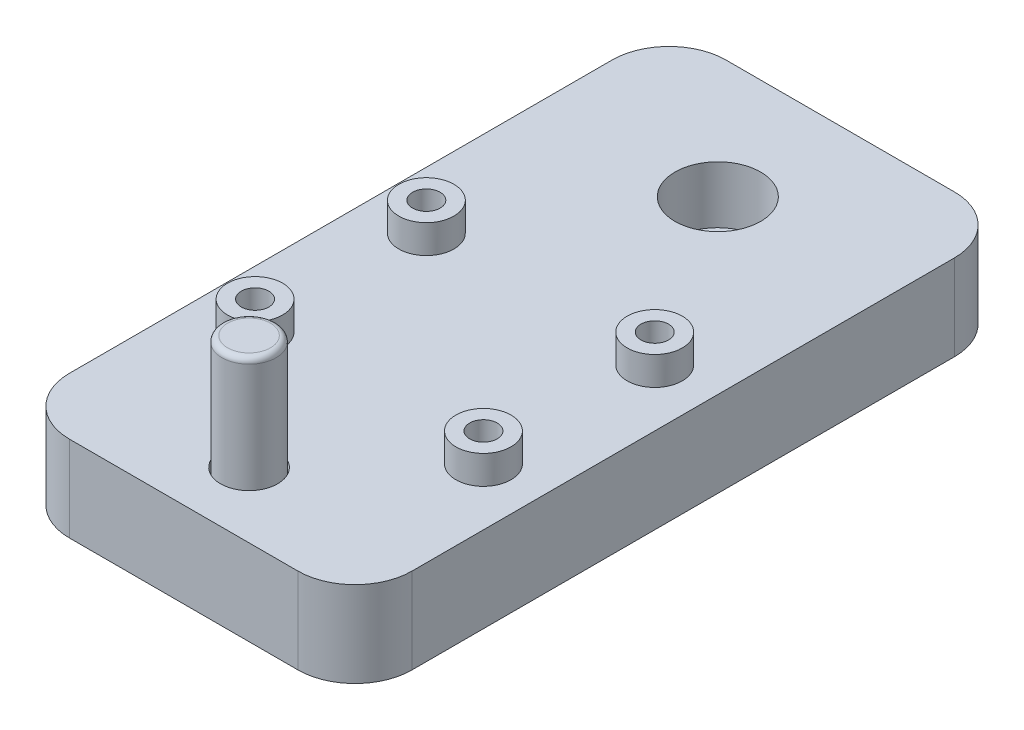
ISO-10303-21;
HEADER;
FILE_DESCRIPTION(('STEP AP214'),'2;1');
FILE_NAME('part.step','',(''),(''),'','','');
FILE_SCHEMA(('AUTOMOTIVE_DESIGN { 1 0 10303 214 1 1 1 1 }'));
ENDSEC;
DATA;
#1=APPLICATION_CONTEXT('core data for automotive mechanical design processes');
#2=APPLICATION_PROTOCOL_DEFINITION('international standard','automotive_design',2000,#1);
#3=PRODUCT_CONTEXT('',#1,'mechanical');
#4=PRODUCT('Part','Part','',(#3));
#5=PRODUCT_RELATED_PRODUCT_CATEGORY('part','',(#4));
#6=PRODUCT_DEFINITION_FORMATION('','',#4);
#7=PRODUCT_DEFINITION_CONTEXT('part definition',#1,'design');
#8=PRODUCT_DEFINITION('design','',#6,#7);
#9=PRODUCT_DEFINITION_SHAPE('','',#8);
#10=(LENGTH_UNIT() NAMED_UNIT(*) SI_UNIT(.MILLI.,.METRE.));
#11=(NAMED_UNIT(*) PLANE_ANGLE_UNIT() SI_UNIT($,.RADIAN.));
#12=(NAMED_UNIT(*) SI_UNIT($,.STERADIAN.) SOLID_ANGLE_UNIT());
#13=UNCERTAINTY_MEASURE_WITH_UNIT(LENGTH_MEASURE(1.E-05),#10,'distance_accuracy_value','');
#14=(GEOMETRIC_REPRESENTATION_CONTEXT(3) GLOBAL_UNCERTAINTY_ASSIGNED_CONTEXT((#13)) GLOBAL_UNIT_ASSIGNED_CONTEXT((#10,
#11,#12)) REPRESENTATION_CONTEXT('',''));
#15=CARTESIAN_POINT('',(0.,0.,0.));
#16=DIRECTION('',(0.,0.,1.));
#17=DIRECTION('',(1.,0.,0.));
#18=AXIS2_PLACEMENT_3D('',#15,#16,#17);
#19=CARTESIAN_POINT('',(0.,15.,0.));
#20=DIRECTION('',(1.,0.,0.));
#21=DIRECTION('',(0.,0.,-1.));
#22=AXIS2_PLACEMENT_3D('',#19,#20,#21);
#23=PLANE('',#22);
#24=DIRECTION('',(0.,0.,1.));
#25=VECTOR('',#24,1.);
#26=CARTESIAN_POINT('',(0.,15.,0.));
#27=LINE('',#26,#25);
#28=CARTESIAN_POINT('',(0.,15.,-105.));
#29=VERTEX_POINT('',#28);
#30=CARTESIAN_POINT('',(0.,15.,-10.));
#31=VERTEX_POINT('',#30);
#32=EDGE_CURVE('E122',#29,#31,#27,.T.);
#33=ORIENTED_EDGE('',*,*,#32,.F.);
#34=DIRECTION('',(0.,-1.,0.));
#35=VECTOR('',#34,1.);
#36=CARTESIAN_POINT('',(0.,15.,-105.));
#37=LINE('',#36,#35);
#38=CARTESIAN_POINT('',(0.,0.,-105.));
#39=VERTEX_POINT('',#38);
#40=EDGE_CURVE('E107',#29,#39,#37,.T.);
#41=ORIENTED_EDGE('',*,*,#40,.T.);
#42=DIRECTION('',(0.,0.,1.));
#43=VECTOR('',#42,1.);
#44=CARTESIAN_POINT('',(0.,0.,0.));
#45=LINE('',#44,#43);
#46=CARTESIAN_POINT('',(0.,0.,-10.));
#47=VERTEX_POINT('',#46);
#48=EDGE_CURVE('E119',#39,#47,#45,.T.);
#49=ORIENTED_EDGE('',*,*,#48,.T.);
#50=DIRECTION('',(0.,-1.,0.));
#51=VECTOR('',#50,1.);
#52=CARTESIAN_POINT('',(0.,15.,-10.));
#53=LINE('',#52,#51);
#54=EDGE_CURVE('E124',#47,#31,#53,.F.);
#55=ORIENTED_EDGE('',*,*,#54,.T.);
#56=EDGE_LOOP('',(#33,#41,#49,#55));
#57=FACE_BOUND('',#56,.T.);
#58=ADVANCED_FACE('F36',(#57),#23,.F.);
#59=CARTESIAN_POINT('',(0.,15.,0.));
#60=DIRECTION('',(0.,0.,-1.));
#61=DIRECTION('',(-1.,0.,0.));
#62=AXIS2_PLACEMENT_3D('',#59,#60,#61);
#63=PLANE('',#62);
#64=DIRECTION('',(1.,0.,0.));
#65=VECTOR('',#64,1.);
#66=CARTESIAN_POINT('',(0.,0.,0.));
#67=LINE('',#66,#65);
#68=CARTESIAN_POINT('',(10.,0.,0.));
#69=VERTEX_POINT('',#68);
#70=CARTESIAN_POINT('',(50.,0.,0.));
#71=VERTEX_POINT('',#70);
#72=EDGE_CURVE('E128',#69,#71,#67,.T.);
#73=ORIENTED_EDGE('',*,*,#72,.T.);
#74=DIRECTION('',(0.,-1.,0.));
#75=VECTOR('',#74,1.);
#76=CARTESIAN_POINT('',(50.,15.,0.));
#77=LINE('',#76,#75);
#78=CARTESIAN_POINT('',(50.,15.,0.));
#79=VERTEX_POINT('',#78);
#80=EDGE_CURVE('E172',#71,#79,#77,.F.);
#81=ORIENTED_EDGE('',*,*,#80,.T.);
#82=DIRECTION('',(1.,0.,0.));
#83=VECTOR('',#82,1.);
#84=CARTESIAN_POINT('',(0.,15.,0.));
#85=LINE('',#84,#83);
#86=CARTESIAN_POINT('',(10.,15.,0.));
#87=VERTEX_POINT('',#86);
#88=EDGE_CURVE('E208',#87,#79,#85,.T.);
#89=ORIENTED_EDGE('',*,*,#88,.F.);
#90=DIRECTION('',(0.,-1.,0.));
#91=VECTOR('',#90,1.);
#92=CARTESIAN_POINT('',(10.,15.,0.));
#93=LINE('',#92,#91);
#94=EDGE_CURVE('E169',#87,#69,#93,.T.);
#95=ORIENTED_EDGE('',*,*,#94,.T.);
#96=EDGE_LOOP('',(#73,#81,#89,#95));
#97=FACE_BOUND('',#96,.T.);
#98=ADVANCED_FACE('F283',(#97),#63,.F.);
#99=CARTESIAN_POINT('',(60.,15.,0.));
#100=DIRECTION('',(-1.,0.,0.));
#101=DIRECTION('',(0.,0.,1.));
#102=AXIS2_PLACEMENT_3D('',#99,#100,#101);
#103=PLANE('',#102);
#104=DIRECTION('',(0.,0.,-1.));
#105=VECTOR('',#104,1.);
#106=CARTESIAN_POINT('',(60.,0.,0.));
#107=LINE('',#106,#105);
#108=CARTESIAN_POINT('',(60.,0.,-10.));
#109=VERTEX_POINT('',#108);
#110=CARTESIAN_POINT('',(60.,0.,-105.));
#111=VERTEX_POINT('',#110);
#112=EDGE_CURVE('E132',#109,#111,#107,.T.);
#113=ORIENTED_EDGE('',*,*,#112,.T.);
#114=DIRECTION('',(0.,-1.,0.));
#115=VECTOR('',#114,1.);
#116=CARTESIAN_POINT('',(60.,15.,-105.));
#117=LINE('',#116,#115);
#118=CARTESIAN_POINT('',(60.,15.,-105.));
#119=VERTEX_POINT('',#118);
#120=EDGE_CURVE('E51',#111,#119,#117,.F.);
#121=ORIENTED_EDGE('',*,*,#120,.T.);
#122=DIRECTION('',(0.,0.,-1.));
#123=VECTOR('',#122,1.);
#124=CARTESIAN_POINT('',(60.,15.,0.));
#125=LINE('',#124,#123);
#126=CARTESIAN_POINT('',(60.,15.,-10.));
#127=VERTEX_POINT('',#126);
#128=EDGE_CURVE('E207',#127,#119,#125,.T.);
#129=ORIENTED_EDGE('',*,*,#128,.F.);
#130=DIRECTION('',(0.,-1.,0.));
#131=VECTOR('',#130,1.);
#132=CARTESIAN_POINT('',(60.,15.,-10.));
#133=LINE('',#132,#131);
#134=EDGE_CURVE('E165',#127,#109,#133,.T.);
#135=ORIENTED_EDGE('',*,*,#134,.T.);
#136=EDGE_LOOP('',(#113,#121,#129,#135));
#137=FACE_BOUND('',#136,.T.);
#138=ADVANCED_FACE('F288',(#137),#103,.F.);
#139=CARTESIAN_POINT('',(0.,15.,-115.));
#140=DIRECTION('',(0.,0.,1.));
#141=DIRECTION('',(1.,0.,0.));
#142=AXIS2_PLACEMENT_3D('',#139,#140,#141);
#143=PLANE('',#142);
#144=DIRECTION('',(-1.,0.,0.));
#145=VECTOR('',#144,1.);
#146=CARTESIAN_POINT('',(0.,0.,-115.));
#147=LINE('',#146,#145);
#148=CARTESIAN_POINT('',(50.,0.,-115.));
#149=VERTEX_POINT('',#148);
#150=CARTESIAN_POINT('',(10.,0.,-115.));
#151=VERTEX_POINT('',#150);
#152=EDGE_CURVE('E142',#149,#151,#147,.T.);
#153=ORIENTED_EDGE('',*,*,#152,.T.);
#154=DIRECTION('',(0.,-1.,0.));
#155=VECTOR('',#154,1.);
#156=CARTESIAN_POINT('',(10.,15.,-115.));
#157=LINE('',#156,#155);
#158=CARTESIAN_POINT('',(10.,15.,-115.));
#159=VERTEX_POINT('',#158);
#160=EDGE_CURVE('E108',#151,#159,#157,.F.);
#161=ORIENTED_EDGE('',*,*,#160,.T.);
#162=DIRECTION('',(-1.,0.,0.));
#163=VECTOR('',#162,1.);
#164=CARTESIAN_POINT('',(0.,15.,-115.));
#165=LINE('',#164,#163);
#166=CARTESIAN_POINT('',(50.,15.,-115.));
#167=VERTEX_POINT('',#166);
#168=EDGE_CURVE('E138',#167,#159,#165,.T.);
#169=ORIENTED_EDGE('',*,*,#168,.F.);
#170=DIRECTION('',(0.,-1.,0.));
#171=VECTOR('',#170,1.);
#172=CARTESIAN_POINT('',(50.,15.,-115.));
#173=LINE('',#172,#171);
#174=EDGE_CURVE('E113',#167,#149,#173,.T.);
#175=ORIENTED_EDGE('',*,*,#174,.T.);
#176=EDGE_LOOP('',(#153,#161,#169,#175));
#177=FACE_BOUND('',#176,.T.);
#178=ADVANCED_FACE('F187',(#177),#143,.F.);
#179=CARTESIAN_POINT('',(0.,15.,0.));
#180=DIRECTION('',(0.,-1.,0.));
#181=DIRECTION('',(0.,0.,-1.));
#182=AXIS2_PLACEMENT_3D('',#179,#180,#181);
#183=PLANE('',#182);
#184=CARTESIAN_POINT('',(50.,15.,-62.5));
#185=DIRECTION('',(0.,-1.,0.));
#186=DIRECTION('',(0.,0.,-1.));
#187=AXIS2_PLACEMENT_3D('',#184,#185,#186);
#188=CIRCLE('',#187,4.826);
#189=CARTESIAN_POINT('',(50.,15.,-67.326));
#190=VERTEX_POINT('',#189);
#191=EDGE_CURVE('E11',#190,#190,#188,.F.);
#192=ORIENTED_EDGE('',*,*,#191,.F.);
#193=EDGE_LOOP('',(#192));
#194=FACE_BOUND('',#193,.T.);
#195=CARTESIAN_POINT('',(10.,15.,-62.5));
#196=DIRECTION('',(0.,-1.,0.));
#197=DIRECTION('',(0.,0.,-1.));
#198=AXIS2_PLACEMENT_3D('',#195,#196,#197);
#199=CIRCLE('',#198,4.826);
#200=CARTESIAN_POINT('',(10.,15.,-67.326));
#201=VERTEX_POINT('',#200);
#202=EDGE_CURVE('E44',#201,#201,#199,.F.);
#203=ORIENTED_EDGE('',*,*,#202,.F.);
#204=EDGE_LOOP('',(#203));
#205=FACE_BOUND('',#204,.T.);
#206=CARTESIAN_POINT('',(10.,15.,-32.5));
#207=DIRECTION('',(0.,-1.,0.));
#208=DIRECTION('',(0.,0.,-1.));
#209=AXIS2_PLACEMENT_3D('',#206,#207,#208);
#210=CIRCLE('',#209,4.826);
#211=CARTESIAN_POINT('',(10.,15.,-37.326));
#212=VERTEX_POINT('',#211);
#213=EDGE_CURVE('E177',#212,#212,#210,.F.);
#214=ORIENTED_EDGE('',*,*,#213,.F.);
#215=EDGE_LOOP('',(#214));
#216=FACE_BOUND('',#215,.T.);
#217=CARTESIAN_POINT('',(50.,15.,-32.5));
#218=DIRECTION('',(0.,-1.,0.));
#219=DIRECTION('',(0.,0.,-1.));
#220=AXIS2_PLACEMENT_3D('',#217,#218,#219);
#221=CIRCLE('',#220,4.826);
#222=CARTESIAN_POINT('',(50.,15.,-37.326));
#223=VERTEX_POINT('',#222);
#224=EDGE_CURVE('E174',#223,#223,#221,.F.);
#225=ORIENTED_EDGE('',*,*,#224,.F.);
#226=EDGE_LOOP('',(#225));
#227=FACE_BOUND('',#226,.T.);
#228=CARTESIAN_POINT('',(30.,15.,-93.55));
#229=DIRECTION('',(0.,1.,0.));
#230=DIRECTION('',(0.,0.,1.));
#231=AXIS2_PLACEMENT_3D('',#228,#229,#230);
#232=CIRCLE('',#231,7.5);
#233=CARTESIAN_POINT('',(30.,15.,-86.05));
#234=VERTEX_POINT('',#233);
#235=EDGE_CURVE('E135',#234,#234,#232,.T.);
#236=ORIENTED_EDGE('',*,*,#235,.F.);
#237=EDGE_LOOP('',(#236));
#238=FACE_BOUND('',#237,.T.);
#239=CARTESIAN_POINT('',(30.,15.,-11.45));
#240=DIRECTION('',(0.,1.,0.));
#241=DIRECTION('',(0.,0.,1.));
#242=AXIS2_PLACEMENT_3D('',#239,#240,#241);
#243=CIRCLE('',#242,5.);
#244=CARTESIAN_POINT('',(30.,15.,-6.45));
#245=VERTEX_POINT('',#244);
#246=EDGE_CURVE('E201',#245,#245,#243,.T.);
#247=ORIENTED_EDGE('',*,*,#246,.F.);
#248=EDGE_LOOP('',(#247));
#249=FACE_BOUND('',#248,.T.);
#250=ORIENTED_EDGE('',*,*,#168,.T.);
#251=CARTESIAN_POINT('',(10.,15.,-105.));
#252=DIRECTION('',(0.,-1.,0.));
#253=DIRECTION('',(0.,0.,-1.));
#254=AXIS2_PLACEMENT_3D('',#251,#252,#253);
#255=CIRCLE('',#254,10.);
#256=EDGE_CURVE('E163',#159,#29,#255,.F.);
#257=ORIENTED_EDGE('',*,*,#256,.T.);
#258=ORIENTED_EDGE('',*,*,#32,.T.);
#259=CARTESIAN_POINT('',(10.,15.,-10.));
#260=DIRECTION('',(0.,-1.,0.));
#261=DIRECTION('',(0.,0.,-1.));
#262=AXIS2_PLACEMENT_3D('',#259,#260,#261);
#263=CIRCLE('',#262,10.);
#264=EDGE_CURVE('E158',#31,#87,#263,.F.);
#265=ORIENTED_EDGE('',*,*,#264,.T.);
#266=ORIENTED_EDGE('',*,*,#88,.T.);
#267=CARTESIAN_POINT('',(50.,15.,-10.));
#268=DIRECTION('',(0.,-1.,0.));
#269=DIRECTION('',(0.,0.,-1.));
#270=AXIS2_PLACEMENT_3D('',#267,#268,#269);
#271=CIRCLE('',#270,10.);
#272=EDGE_CURVE('E58',#79,#127,#271,.F.);
#273=ORIENTED_EDGE('',*,*,#272,.T.);
#274=ORIENTED_EDGE('',*,*,#128,.T.);
#275=CARTESIAN_POINT('',(50.,15.,-105.));
#276=DIRECTION('',(0.,-1.,0.));
#277=DIRECTION('',(0.,0.,-1.));
#278=AXIS2_PLACEMENT_3D('',#275,#276,#277);
#279=CIRCLE('',#278,10.);
#280=EDGE_CURVE('E161',#119,#167,#279,.F.);
#281=ORIENTED_EDGE('',*,*,#280,.T.);
#282=EDGE_LOOP('',(#250,#257,#258,#265,#266,#273,#274,#281));
#283=FACE_BOUND('',#282,.T.);
#284=ADVANCED_FACE('F184',(#194,#205,#216,#227,#238,#249,#283),#183,.F.);
#285=CARTESIAN_POINT('',(0.,0.,0.));
#286=DIRECTION('',(0.,-1.,0.));
#287=DIRECTION('',(0.,0.,-1.));
#288=AXIS2_PLACEMENT_3D('',#285,#286,#287);
#289=PLANE('',#288);
#290=CARTESIAN_POINT('',(30.,0.,-57.5));
#291=DIRECTION('',(0.,-1.,0.));
#292=DIRECTION('',(0.,0.,-1.));
#293=AXIS2_PLACEMENT_3D('',#290,#291,#292);
#294=CIRCLE('',#293,5.);
#295=CARTESIAN_POINT('',(30.,0.,-62.5));
#296=VERTEX_POINT('',#295);
#297=EDGE_CURVE('E218',#296,#296,#294,.T.);
#298=ORIENTED_EDGE('',*,*,#297,.F.);
#299=EDGE_LOOP('',(#298));
#300=FACE_BOUND('',#299,.T.);
#301=ORIENTED_EDGE('',*,*,#48,.F.);
#302=CARTESIAN_POINT('',(10.,0.,-105.));
#303=DIRECTION('',(0.,-1.,0.));
#304=DIRECTION('',(0.,0.,-1.));
#305=AXIS2_PLACEMENT_3D('',#302,#303,#304);
#306=CIRCLE('',#305,10.);
#307=EDGE_CURVE('E103',#39,#151,#306,.T.);
#308=ORIENTED_EDGE('',*,*,#307,.T.);
#309=ORIENTED_EDGE('',*,*,#152,.F.);
#310=CARTESIAN_POINT('',(50.,0.,-105.));
#311=DIRECTION('',(0.,-1.,0.));
#312=DIRECTION('',(0.,0.,-1.));
#313=AXIS2_PLACEMENT_3D('',#310,#311,#312);
#314=CIRCLE('',#313,10.);
#315=EDGE_CURVE('E114',#149,#111,#314,.T.);
#316=ORIENTED_EDGE('',*,*,#315,.T.);
#317=ORIENTED_EDGE('',*,*,#112,.F.);
#318=CARTESIAN_POINT('',(50.,0.,-10.));
#319=DIRECTION('',(0.,-1.,0.));
#320=DIRECTION('',(0.,0.,-1.));
#321=AXIS2_PLACEMENT_3D('',#318,#319,#320);
#322=CIRCLE('',#321,10.);
#323=EDGE_CURVE('E152',#109,#71,#322,.T.);
#324=ORIENTED_EDGE('',*,*,#323,.T.);
#325=ORIENTED_EDGE('',*,*,#72,.F.);
#326=CARTESIAN_POINT('',(10.,0.,-10.));
#327=DIRECTION('',(0.,-1.,0.));
#328=DIRECTION('',(0.,0.,-1.));
#329=AXIS2_PLACEMENT_3D('',#326,#327,#328);
#330=CIRCLE('',#329,10.);
#331=EDGE_CURVE('E123',#69,#47,#330,.T.);
#332=ORIENTED_EDGE('',*,*,#331,.T.);
#333=EDGE_LOOP('',(#301,#308,#309,#316,#317,#324,#325,#332));
#334=FACE_BOUND('',#333,.T.);
#335=ADVANCED_FACE('F126',(#300,#334),#289,.T.);
#336=CARTESIAN_POINT('',(30.,5.,-11.45));
#337=DIRECTION('',(0.,1.,0.));
#338=DIRECTION('',(0.,0.,1.));
#339=AXIS2_PLACEMENT_3D('',#336,#337,#338);
#340=CYLINDRICAL_SURFACE('',#339,5.);
#341=CARTESIAN_POINT('',(30.,5.,-11.45));
#342=DIRECTION('',(0.,1.,0.));
#343=DIRECTION('',(0.,0.,1.));
#344=AXIS2_PLACEMENT_3D('',#341,#342,#343);
#345=CIRCLE('',#344,5.);
#346=CARTESIAN_POINT('',(30.,5.,-6.45));
#347=VERTEX_POINT('',#346);
#348=EDGE_CURVE('E213',#347,#347,#345,.T.);
#349=ORIENTED_EDGE('',*,*,#348,.F.);
#350=EDGE_LOOP('',(#349));
#351=FACE_BOUND('',#350,.T.);
#352=ORIENTED_EDGE('',*,*,#246,.T.);
#353=EDGE_LOOP('',(#352));
#354=FACE_BOUND('',#353,.T.);
#355=ADVANCED_FACE('F321',(#351,#354),#340,.F.);
#356=CARTESIAN_POINT('',(30.,5.,-11.45));
#357=DIRECTION('',(0.,1.,0.));
#358=DIRECTION('',(0.,0.,1.));
#359=AXIS2_PLACEMENT_3D('',#356,#357,#358);
#360=PLANE('',#359);
#361=CARTESIAN_POINT('',(30.,5.,-11.45));
#362=DIRECTION('',(0.,1.,0.));
#363=DIRECTION('',(0.,0.,1.));
#364=AXIS2_PLACEMENT_3D('',#361,#362,#363);
#365=CIRCLE('',#364,4.75);
#366=CARTESIAN_POINT('',(30.,5.,-6.7));
#367=VERTEX_POINT('',#366);
#368=EDGE_CURVE('E221',#367,#367,#365,.T.);
#369=ORIENTED_EDGE('',*,*,#368,.F.);
#370=EDGE_LOOP('',(#369));
#371=FACE_BOUND('',#370,.T.);
#372=ORIENTED_EDGE('',*,*,#348,.T.);
#373=EDGE_LOOP('',(#372));
#374=FACE_BOUND('',#373,.T.);
#375=ADVANCED_FACE('F326',(#371,#374),#360,.T.);
#376=CARTESIAN_POINT('',(30.,5.,-93.55));
#377=DIRECTION('',(0.,1.,0.));
#378=DIRECTION('',(0.,0.,1.));
#379=AXIS2_PLACEMENT_3D('',#376,#377,#378);
#380=CYLINDRICAL_SURFACE('',#379,7.5);
#381=CARTESIAN_POINT('',(30.,5.,-93.55));
#382=DIRECTION('',(0.,1.,0.));
#383=DIRECTION('',(0.,0.,1.));
#384=AXIS2_PLACEMENT_3D('',#381,#382,#383);
#385=CIRCLE('',#384,7.5);
#386=CARTESIAN_POINT('',(30.,5.,-86.05));
#387=VERTEX_POINT('',#386);
#388=EDGE_CURVE('E129',#387,#387,#385,.T.);
#389=ORIENTED_EDGE('',*,*,#388,.F.);
#390=EDGE_LOOP('',(#389));
#391=FACE_BOUND('',#390,.T.);
#392=ORIENTED_EDGE('',*,*,#235,.T.);
#393=EDGE_LOOP('',(#392));
#394=FACE_BOUND('',#393,.T.);
#395=ADVANCED_FACE('F330',(#391,#394),#380,.F.);
#396=CARTESIAN_POINT('',(30.,5.,-93.55));
#397=DIRECTION('',(0.,1.,0.));
#398=DIRECTION('',(0.,0.,1.));
#399=AXIS2_PLACEMENT_3D('',#396,#397,#398);
#400=PLANE('',#399);
#401=ORIENTED_EDGE('',*,*,#388,.T.);
#402=EDGE_LOOP('',(#401));
#403=FACE_BOUND('',#402,.T.);
#404=ADVANCED_FACE('F334',(#403),#400,.T.);
#405=CARTESIAN_POINT('',(30.,14.5,-57.5));
#406=DIRECTION('',(0.,-1.,0.));
#407=DIRECTION('',(0.,0.,-1.));
#408=AXIS2_PLACEMENT_3D('',#405,#406,#407);
#409=CYLINDRICAL_SURFACE('',#408,5.);
#410=CARTESIAN_POINT('',(30.,14.5,-57.5));
#411=DIRECTION('',(0.,-1.,0.));
#412=DIRECTION('',(0.,0.,-1.));
#413=AXIS2_PLACEMENT_3D('',#410,#411,#412);
#414=CIRCLE('',#413,5.);
#415=CARTESIAN_POINT('',(30.,14.5,-62.5));
#416=VERTEX_POINT('',#415);
#417=EDGE_CURVE('E214',#416,#416,#414,.T.);
#418=ORIENTED_EDGE('',*,*,#417,.F.);
#419=EDGE_LOOP('',(#418));
#420=FACE_BOUND('',#419,.T.);
#421=ORIENTED_EDGE('',*,*,#297,.T.);
#422=EDGE_LOOP('',(#421));
#423=FACE_BOUND('',#422,.T.);
#424=ADVANCED_FACE('F338',(#420,#423),#409,.F.);
#425=CARTESIAN_POINT('',(30.,14.5,-57.5));
#426=DIRECTION('',(0.,-1.,0.));
#427=DIRECTION('',(0.,0.,-1.));
#428=AXIS2_PLACEMENT_3D('',#425,#426,#427);
#429=PLANE('',#428);
#430=ORIENTED_EDGE('',*,*,#417,.T.);
#431=EDGE_LOOP('',(#430));
#432=FACE_BOUND('',#431,.T.);
#433=ADVANCED_FACE('F342',(#432),#429,.T.);
#434=CARTESIAN_POINT('',(30.,35.,-11.45));
#435=DIRECTION('',(0.,-1.,0.));
#436=DIRECTION('',(0.,0.,-1.));
#437=AXIS2_PLACEMENT_3D('',#434,#435,#436);
#438=CYLINDRICAL_SURFACE('',#437,4.75);
#439=CARTESIAN_POINT('',(30.,34.,-11.45));
#440=DIRECTION('',(0.,1.,0.));
#441=DIRECTION('',(0.,0.,1.));
#442=AXIS2_PLACEMENT_3D('',#439,#440,#441);
#443=CIRCLE('',#442,4.75);
#444=CARTESIAN_POINT('',(30.,34.,-6.7));
#445=VERTEX_POINT('',#444);
#446=EDGE_CURVE('E147',#445,#445,#443,.F.);
#447=ORIENTED_EDGE('',*,*,#446,.T.);
#448=EDGE_LOOP('',(#447));
#449=FACE_BOUND('',#448,.T.);
#450=ORIENTED_EDGE('',*,*,#368,.T.);
#451=EDGE_LOOP('',(#450));
#452=FACE_BOUND('',#451,.T.);
#453=ADVANCED_FACE('F346',(#449,#452),#438,.T.);
#454=CARTESIAN_POINT('',(30.,35.,-11.45));
#455=DIRECTION('',(0.,1.,0.));
#456=DIRECTION('',(0.,0.,1.));
#457=AXIS2_PLACEMENT_3D('',#454,#455,#456);
#458=PLANE('',#457);
#459=CARTESIAN_POINT('',(30.,35.,-11.45));
#460=DIRECTION('',(0.,1.,0.));
#461=DIRECTION('',(0.,0.,1.));
#462=AXIS2_PLACEMENT_3D('',#459,#460,#461);
#463=CIRCLE('',#462,3.75);
#464=CARTESIAN_POINT('',(30.,35.,-7.7));
#465=VERTEX_POINT('',#464);
#466=EDGE_CURVE('E144',#465,#465,#463,.T.);
#467=ORIENTED_EDGE('',*,*,#466,.T.);
#468=EDGE_LOOP('',(#467));
#469=FACE_BOUND('',#468,.T.);
#470=ADVANCED_FACE('F296',(#469),#458,.T.);
#471=CARTESIAN_POINT('',(30.,34.,-11.45));
#472=DIRECTION('',(0.,1.,0.));
#473=DIRECTION('',(0.,0.,1.));
#474=AXIS2_PLACEMENT_3D('',#471,#472,#473);
#475=TOROIDAL_SURFACE('',#474,3.75,1.);
#476=ORIENTED_EDGE('',*,*,#446,.F.);
#477=EDGE_LOOP('',(#476));
#478=FACE_BOUND('',#477,.T.);
#479=ORIENTED_EDGE('',*,*,#466,.F.);
#480=EDGE_LOOP('',(#479));
#481=FACE_BOUND('',#480,.T.);
#482=ADVANCED_FACE('F293',(#478,#481),#475,.T.);
#483=CARTESIAN_POINT('',(10.,15.,-105.));
#484=DIRECTION('',(0.,-1.,0.));
#485=DIRECTION('',(0.,0.,-1.));
#486=AXIS2_PLACEMENT_3D('',#483,#484,#485);
#487=CYLINDRICAL_SURFACE('',#486,10.);
#488=ORIENTED_EDGE('',*,*,#256,.F.);
#489=ORIENTED_EDGE('',*,*,#160,.F.);
#490=ORIENTED_EDGE('',*,*,#307,.F.);
#491=ORIENTED_EDGE('',*,*,#40,.F.);
#492=EDGE_LOOP('',(#488,#489,#490,#491));
#493=FACE_BOUND('',#492,.T.);
#494=ADVANCED_FACE('F106',(#493),#487,.T.);
#495=CARTESIAN_POINT('',(50.,15.,-105.));
#496=DIRECTION('',(0.,-1.,0.));
#497=DIRECTION('',(0.,0.,-1.));
#498=AXIS2_PLACEMENT_3D('',#495,#496,#497);
#499=CYLINDRICAL_SURFACE('',#498,10.);
#500=ORIENTED_EDGE('',*,*,#280,.F.);
#501=ORIENTED_EDGE('',*,*,#120,.F.);
#502=ORIENTED_EDGE('',*,*,#315,.F.);
#503=ORIENTED_EDGE('',*,*,#174,.F.);
#504=EDGE_LOOP('',(#500,#501,#502,#503));
#505=FACE_BOUND('',#504,.T.);
#506=ADVANCED_FACE('F300',(#505),#499,.T.);
#507=CARTESIAN_POINT('',(50.,15.,-10.));
#508=DIRECTION('',(0.,-1.,0.));
#509=DIRECTION('',(0.,0.,-1.));
#510=AXIS2_PLACEMENT_3D('',#507,#508,#509);
#511=CYLINDRICAL_SURFACE('',#510,10.);
#512=ORIENTED_EDGE('',*,*,#272,.F.);
#513=ORIENTED_EDGE('',*,*,#80,.F.);
#514=ORIENTED_EDGE('',*,*,#323,.F.);
#515=ORIENTED_EDGE('',*,*,#134,.F.);
#516=EDGE_LOOP('',(#512,#513,#514,#515));
#517=FACE_BOUND('',#516,.T.);
#518=ADVANCED_FACE('F302',(#517),#511,.T.);
#519=CARTESIAN_POINT('',(10.,15.,-10.));
#520=DIRECTION('',(0.,-1.,0.));
#521=DIRECTION('',(0.,0.,-1.));
#522=AXIS2_PLACEMENT_3D('',#519,#520,#521);
#523=CYLINDRICAL_SURFACE('',#522,10.);
#524=ORIENTED_EDGE('',*,*,#264,.F.);
#525=ORIENTED_EDGE('',*,*,#54,.F.);
#526=ORIENTED_EDGE('',*,*,#331,.F.);
#527=ORIENTED_EDGE('',*,*,#94,.F.);
#528=EDGE_LOOP('',(#524,#525,#526,#527));
#529=FACE_BOUND('',#528,.T.);
#530=ADVANCED_FACE('F38',(#529),#523,.T.);
#531=CARTESIAN_POINT('',(50.,20.,-32.5));
#532=DIRECTION('',(0.,1.,0.));
#533=DIRECTION('',(0.,0.,1.));
#534=AXIS2_PLACEMENT_3D('',#531,#532,#533);
#535=PLANE('',#534);
#536=CARTESIAN_POINT('',(50.,20.,-32.5));
#537=DIRECTION('',(0.,1.,0.));
#538=DIRECTION('',(0.,0.,1.));
#539=AXIS2_PLACEMENT_3D('',#536,#537,#538);
#540=CIRCLE('',#539,4.826);
#541=CARTESIAN_POINT('',(50.,20.,-27.674));
#542=VERTEX_POINT('',#541);
#543=EDGE_CURVE('E226',#542,#542,#540,.T.);
#544=ORIENTED_EDGE('',*,*,#543,.T.);
#545=EDGE_LOOP('',(#544));
#546=FACE_BOUND('',#545,.T.);
#547=CARTESIAN_POINT('',(50.,20.,-32.5));
#548=DIRECTION('',(0.,1.,0.));
#549=DIRECTION('',(0.,0.,1.));
#550=AXIS2_PLACEMENT_3D('',#547,#548,#549);
#551=CIRCLE('',#550,2.41299999999999);
#552=CARTESIAN_POINT('',(50.,20.,-30.087));
#553=VERTEX_POINT('',#552);
#554=EDGE_CURVE('E229',#553,#553,#551,.T.);
#555=ORIENTED_EDGE('',*,*,#554,.F.);
#556=EDGE_LOOP('',(#555));
#557=FACE_BOUND('',#556,.T.);
#558=ADVANCED_FACE('F309',(#546,#557),#535,.T.);
#559=CARTESIAN_POINT('',(50.,20.,-32.5));
#560=DIRECTION('',(0.,-1.,0.));
#561=DIRECTION('',(0.,0.,-1.));
#562=AXIS2_PLACEMENT_3D('',#559,#560,#561);
#563=CYLINDRICAL_SURFACE('',#562,4.826);
#564=ORIENTED_EDGE('',*,*,#543,.F.);
#565=EDGE_LOOP('',(#564));
#566=FACE_BOUND('',#565,.T.);
#567=ORIENTED_EDGE('',*,*,#224,.T.);
#568=EDGE_LOOP('',(#567));
#569=FACE_BOUND('',#568,.T.);
#570=ADVANCED_FACE('F354',(#566,#569),#563,.T.);
#571=CARTESIAN_POINT('',(50.,20.,-32.5));
#572=DIRECTION('',(0.,-1.,0.));
#573=DIRECTION('',(0.,0.,-1.));
#574=AXIS2_PLACEMENT_3D('',#571,#572,#573);
#575=CYLINDRICAL_SURFACE('',#574,2.41299999999999);
#576=ORIENTED_EDGE('',*,*,#554,.T.);
#577=EDGE_LOOP('',(#576));
#578=FACE_BOUND('',#577,.T.);
#579=CARTESIAN_POINT('',(50.,15.,-32.5));
#580=DIRECTION('',(0.,1.,0.));
#581=DIRECTION('',(0.,0.,1.));
#582=AXIS2_PLACEMENT_3D('',#579,#580,#581);
#583=CIRCLE('',#582,2.41299999999999);
#584=CARTESIAN_POINT('',(50.,15.,-30.087));
#585=VERTEX_POINT('',#584);
#586=EDGE_CURVE('E230',#585,#585,#583,.T.);
#587=ORIENTED_EDGE('',*,*,#586,.F.);
#588=EDGE_LOOP('',(#587));
#589=FACE_BOUND('',#588,.T.);
#590=ADVANCED_FACE('F357',(#578,#589),#575,.F.);
#591=ORIENTED_EDGE('',*,*,#586,.T.);
#592=EDGE_LOOP('',(#591));
#593=FACE_BOUND('',#592,.T.);
#594=ADVANCED_FACE('F191',(#593),#183,.F.);
#595=CARTESIAN_POINT('',(10.,20.,-32.5));
#596=DIRECTION('',(0.,1.,0.));
#597=DIRECTION('',(0.,0.,1.));
#598=AXIS2_PLACEMENT_3D('',#595,#596,#597);
#599=PLANE('',#598);
#600=CARTESIAN_POINT('',(10.,20.,-32.5));
#601=DIRECTION('',(0.,1.,0.));
#602=DIRECTION('',(0.,0.,1.));
#603=AXIS2_PLACEMENT_3D('',#600,#601,#602);
#604=CIRCLE('',#603,4.826);
#605=CARTESIAN_POINT('',(10.,20.,-27.674));
#606=VERTEX_POINT('',#605);
#607=EDGE_CURVE('E233',#606,#606,#604,.T.);
#608=ORIENTED_EDGE('',*,*,#607,.T.);
#609=EDGE_LOOP('',(#608));
#610=FACE_BOUND('',#609,.T.);
#611=CARTESIAN_POINT('',(10.,20.,-32.5));
#612=DIRECTION('',(0.,1.,0.));
#613=DIRECTION('',(0.,0.,1.));
#614=AXIS2_PLACEMENT_3D('',#611,#612,#613);
#615=CIRCLE('',#614,2.413);
#616=CARTESIAN_POINT('',(10.,20.,-30.087));
#617=VERTEX_POINT('',#616);
#618=EDGE_CURVE('E238',#617,#617,#615,.T.);
#619=ORIENTED_EDGE('',*,*,#618,.F.);
#620=EDGE_LOOP('',(#619));
#621=FACE_BOUND('',#620,.T.);
#622=ADVANCED_FACE('F369',(#610,#621),#599,.T.);
#623=CARTESIAN_POINT('',(10.,20.,-32.5));
#624=DIRECTION('',(0.,-1.,0.));
#625=DIRECTION('',(0.,0.,-1.));
#626=AXIS2_PLACEMENT_3D('',#623,#624,#625);
#627=CYLINDRICAL_SURFACE('',#626,4.826);
#628=ORIENTED_EDGE('',*,*,#607,.F.);
#629=EDGE_LOOP('',(#628));
#630=FACE_BOUND('',#629,.T.);
#631=ORIENTED_EDGE('',*,*,#213,.T.);
#632=EDGE_LOOP('',(#631));
#633=FACE_BOUND('',#632,.T.);
#634=ADVANCED_FACE('F365',(#630,#633),#627,.T.);
#635=CARTESIAN_POINT('',(10.,20.,-32.5));
#636=DIRECTION('',(0.,-1.,0.));
#637=DIRECTION('',(0.,0.,-1.));
#638=AXIS2_PLACEMENT_3D('',#635,#636,#637);
#639=CYLINDRICAL_SURFACE('',#638,2.413);
#640=ORIENTED_EDGE('',*,*,#618,.T.);
#641=EDGE_LOOP('',(#640));
#642=FACE_BOUND('',#641,.T.);
#643=CARTESIAN_POINT('',(10.,15.,-32.5));
#644=DIRECTION('',(0.,1.,0.));
#645=DIRECTION('',(0.,0.,1.));
#646=AXIS2_PLACEMENT_3D('',#643,#644,#645);
#647=CIRCLE('',#646,2.413);
#648=CARTESIAN_POINT('',(10.,15.,-30.087));
#649=VERTEX_POINT('',#648);
#650=EDGE_CURVE('E239',#649,#649,#647,.T.);
#651=ORIENTED_EDGE('',*,*,#650,.F.);
#652=EDGE_LOOP('',(#651));
#653=FACE_BOUND('',#652,.T.);
#654=ADVANCED_FACE('F368',(#642,#653),#639,.F.);
#655=ORIENTED_EDGE('',*,*,#650,.T.);
#656=EDGE_LOOP('',(#655));
#657=FACE_BOUND('',#656,.T.);
#658=ADVANCED_FACE('F280',(#657),#183,.F.);
#659=CARTESIAN_POINT('',(10.,20.,-62.5));
#660=DIRECTION('',(0.,1.,0.));
#661=DIRECTION('',(0.,0.,1.));
#662=AXIS2_PLACEMENT_3D('',#659,#660,#661);
#663=PLANE('',#662);
#664=CARTESIAN_POINT('',(10.,20.,-62.5));
#665=DIRECTION('',(0.,1.,0.));
#666=DIRECTION('',(0.,0.,1.));
#667=AXIS2_PLACEMENT_3D('',#664,#665,#666);
#668=CIRCLE('',#667,4.826);
#669=CARTESIAN_POINT('',(10.,20.,-57.674));
#670=VERTEX_POINT('',#669);
#671=EDGE_CURVE('E242',#670,#670,#668,.T.);
#672=ORIENTED_EDGE('',*,*,#671,.T.);
#673=EDGE_LOOP('',(#672));
#674=FACE_BOUND('',#673,.T.);
#675=CARTESIAN_POINT('',(10.,20.,-62.5));
#676=DIRECTION('',(0.,1.,0.));
#677=DIRECTION('',(0.,0.,1.));
#678=AXIS2_PLACEMENT_3D('',#675,#676,#677);
#679=CIRCLE('',#678,2.413);
#680=CARTESIAN_POINT('',(10.,20.,-60.087));
#681=VERTEX_POINT('',#680);
#682=EDGE_CURVE('E247',#681,#681,#679,.T.);
#683=ORIENTED_EDGE('',*,*,#682,.F.);
#684=EDGE_LOOP('',(#683));
#685=FACE_BOUND('',#684,.T.);
#686=ADVANCED_FACE('F379',(#674,#685),#663,.T.);
#687=CARTESIAN_POINT('',(10.,20.,-62.5));
#688=DIRECTION('',(0.,-1.,0.));
#689=DIRECTION('',(0.,0.,-1.));
#690=AXIS2_PLACEMENT_3D('',#687,#688,#689);
#691=CYLINDRICAL_SURFACE('',#690,4.826);
#692=ORIENTED_EDGE('',*,*,#671,.F.);
#693=EDGE_LOOP('',(#692));
#694=FACE_BOUND('',#693,.T.);
#695=ORIENTED_EDGE('',*,*,#202,.T.);
#696=EDGE_LOOP('',(#695));
#697=FACE_BOUND('',#696,.T.);
#698=ADVANCED_FACE('F182',(#694,#697),#691,.T.);
#699=CARTESIAN_POINT('',(10.,20.,-62.5));
#700=DIRECTION('',(0.,-1.,0.));
#701=DIRECTION('',(0.,0.,-1.));
#702=AXIS2_PLACEMENT_3D('',#699,#700,#701);
#703=CYLINDRICAL_SURFACE('',#702,2.413);
#704=ORIENTED_EDGE('',*,*,#682,.T.);
#705=EDGE_LOOP('',(#704));
#706=FACE_BOUND('',#705,.T.);
#707=CARTESIAN_POINT('',(10.,15.,-62.5));
#708=DIRECTION('',(0.,1.,0.));
#709=DIRECTION('',(0.,0.,1.));
#710=AXIS2_PLACEMENT_3D('',#707,#708,#709);
#711=CIRCLE('',#710,2.413);
#712=CARTESIAN_POINT('',(10.,15.,-60.087));
#713=VERTEX_POINT('',#712);
#714=EDGE_CURVE('E248',#713,#713,#711,.T.);
#715=ORIENTED_EDGE('',*,*,#714,.F.);
#716=EDGE_LOOP('',(#715));
#717=FACE_BOUND('',#716,.T.);
#718=ADVANCED_FACE('F278',(#706,#717),#703,.F.);
#719=ORIENTED_EDGE('',*,*,#714,.T.);
#720=EDGE_LOOP('',(#719));
#721=FACE_BOUND('',#720,.T.);
#722=ADVANCED_FACE('F269',(#721),#183,.F.);
#723=CARTESIAN_POINT('',(50.,20.,-62.5));
#724=DIRECTION('',(0.,1.,0.));
#725=DIRECTION('',(0.,0.,1.));
#726=AXIS2_PLACEMENT_3D('',#723,#724,#725);
#727=PLANE('',#726);
#728=CARTESIAN_POINT('',(50.,20.,-62.5));
#729=DIRECTION('',(0.,1.,0.));
#730=DIRECTION('',(0.,0.,1.));
#731=AXIS2_PLACEMENT_3D('',#728,#729,#730);
#732=CIRCLE('',#731,4.826);
#733=CARTESIAN_POINT('',(50.,20.,-57.674));
#734=VERTEX_POINT('',#733);
#735=EDGE_CURVE('E251',#734,#734,#732,.T.);
#736=ORIENTED_EDGE('',*,*,#735,.T.);
#737=EDGE_LOOP('',(#736));
#738=FACE_BOUND('',#737,.T.);
#739=CARTESIAN_POINT('',(50.,20.,-62.5));
#740=DIRECTION('',(0.,1.,0.));
#741=DIRECTION('',(0.,0.,1.));
#742=AXIS2_PLACEMENT_3D('',#739,#740,#741);
#743=CIRCLE('',#742,2.41299999999999);
#744=CARTESIAN_POINT('',(50.,20.,-60.087));
#745=VERTEX_POINT('',#744);
#746=EDGE_CURVE('E256',#745,#745,#743,.T.);
#747=ORIENTED_EDGE('',*,*,#746,.F.);
#748=EDGE_LOOP('',(#747));
#749=FACE_BOUND('',#748,.T.);
#750=ADVANCED_FACE('F266',(#738,#749),#727,.T.);
#751=CARTESIAN_POINT('',(50.,20.,-62.5));
#752=DIRECTION('',(0.,-1.,0.));
#753=DIRECTION('',(0.,0.,-1.));
#754=AXIS2_PLACEMENT_3D('',#751,#752,#753);
#755=CYLINDRICAL_SURFACE('',#754,4.826);
#756=ORIENTED_EDGE('',*,*,#735,.F.);
#757=EDGE_LOOP('',(#756));
#758=FACE_BOUND('',#757,.T.);
#759=ORIENTED_EDGE('',*,*,#191,.T.);
#760=EDGE_LOOP('',(#759));
#761=FACE_BOUND('',#760,.T.);
#762=ADVANCED_FACE('F268',(#758,#761),#755,.T.);
#763=CARTESIAN_POINT('',(50.,20.,-62.5));
#764=DIRECTION('',(0.,-1.,0.));
#765=DIRECTION('',(0.,0.,-1.));
#766=AXIS2_PLACEMENT_3D('',#763,#764,#765);
#767=CYLINDRICAL_SURFACE('',#766,2.41299999999999);
#768=ORIENTED_EDGE('',*,*,#746,.T.);
#769=EDGE_LOOP('',(#768));
#770=FACE_BOUND('',#769,.T.);
#771=CARTESIAN_POINT('',(50.,15.,-62.5));
#772=DIRECTION('',(0.,1.,0.));
#773=DIRECTION('',(0.,0.,1.));
#774=AXIS2_PLACEMENT_3D('',#771,#772,#773);
#775=CIRCLE('',#774,2.41299999999999);
#776=CARTESIAN_POINT('',(50.,15.,-60.087));
#777=VERTEX_POINT('',#776);
#778=EDGE_CURVE('E257',#777,#777,#775,.T.);
#779=ORIENTED_EDGE('',*,*,#778,.F.);
#780=EDGE_LOOP('',(#779));
#781=FACE_BOUND('',#780,.T.);
#782=ADVANCED_FACE('F263',(#770,#781),#767,.F.);
#783=ORIENTED_EDGE('',*,*,#778,.T.);
#784=EDGE_LOOP('',(#783));
#785=FACE_BOUND('',#784,.T.);
#786=ADVANCED_FACE('F190',(#785),#183,.F.);
#787=CLOSED_SHELL('',(#58,#98,#138,#178,#284,#335,#355,#375,#395,#404,#424,#433,#453,#470,#482,
#494,#506,#518,#530,#558,#570,#590,#594,#622,#634,#654,#658,#686,#698,#718,#722,#750,#762,#782,#786));
#788=MANIFOLD_SOLID_BREP('B2',#787);
#789=ADVANCED_BREP_SHAPE_REPRESENTATION('',(#18,#788),#14);
#790=SHAPE_DEFINITION_REPRESENTATION(#9,#789);
ENDSEC;
END-ISO-10303-21;
